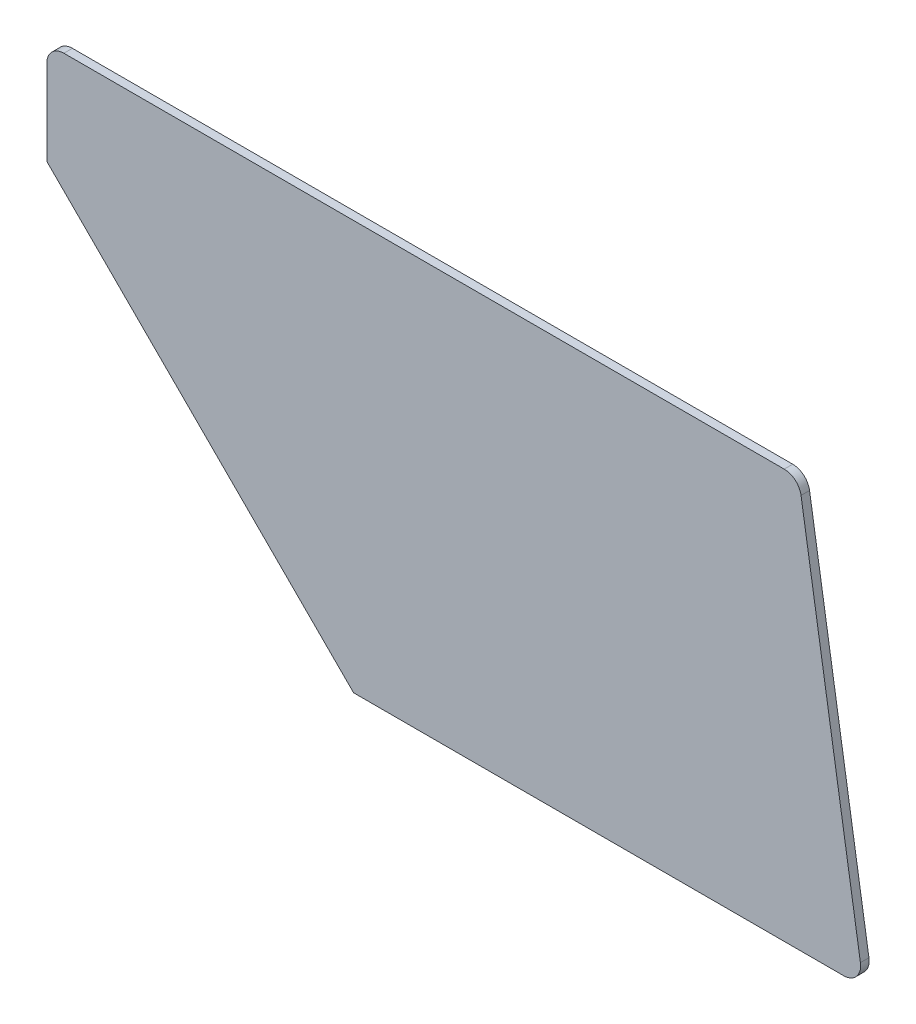
ISO-10303-21;
HEADER;
FILE_DESCRIPTION(('STEP AP214'),'2;1');
FILE_NAME('part.step','',(''),(''),'','','');
FILE_SCHEMA(('AUTOMOTIVE_DESIGN { 1 0 10303 214 1 1 1 1 }'));
ENDSEC;
DATA;
#1=APPLICATION_CONTEXT('core data for automotive mechanical design processes');
#2=APPLICATION_PROTOCOL_DEFINITION('international standard','automotive_design',2000,#1);
#3=PRODUCT_CONTEXT('',#1,'mechanical');
#4=PRODUCT('Part','Part','',(#3));
#5=PRODUCT_RELATED_PRODUCT_CATEGORY('part','',(#4));
#6=PRODUCT_DEFINITION_FORMATION('','',#4);
#7=PRODUCT_DEFINITION_CONTEXT('part definition',#1,'design');
#8=PRODUCT_DEFINITION('design','',#6,#7);
#9=PRODUCT_DEFINITION_SHAPE('','',#8);
#10=(LENGTH_UNIT() NAMED_UNIT(*) SI_UNIT(.MILLI.,.METRE.));
#11=(NAMED_UNIT(*) PLANE_ANGLE_UNIT() SI_UNIT($,.RADIAN.));
#12=(NAMED_UNIT(*) SI_UNIT($,.STERADIAN.) SOLID_ANGLE_UNIT());
#13=UNCERTAINTY_MEASURE_WITH_UNIT(LENGTH_MEASURE(1.E-05),#10,'distance_accuracy_value','');
#14=(GEOMETRIC_REPRESENTATION_CONTEXT(3) GLOBAL_UNCERTAINTY_ASSIGNED_CONTEXT((#13)) GLOBAL_UNIT_ASSIGNED_CONTEXT((#10,
#11,#12)) REPRESENTATION_CONTEXT('',''));
#15=CARTESIAN_POINT('',(0.,0.,0.));
#16=DIRECTION('',(0.,0.,1.));
#17=DIRECTION('',(1.,0.,0.));
#18=AXIS2_PLACEMENT_3D('',#15,#16,#17);
#19=CARTESIAN_POINT('',(0.,-38.1,3.175));
#20=DIRECTION('',(0.707106781186549,0.707106781186546,0.));
#21=DIRECTION('',(-0.707106781186546,0.707106781186549,0.));
#22=AXIS2_PLACEMENT_3D('',#19,#20,#21);
#23=PLANE('',#22);
#24=DIRECTION('',(0.707106781186546,-0.707106781186549,0.));
#25=VECTOR('',#24,1.);
#26=CARTESIAN_POINT('',(0.,-38.1,0.));
#27=LINE('',#26,#25);
#28=CARTESIAN_POINT('',(0.,-38.1,0.));
#29=VERTEX_POINT('',#28);
#30=CARTESIAN_POINT('',(114.3,-152.4,0.));
#31=VERTEX_POINT('',#30);
#32=EDGE_CURVE('E128',#29,#31,#27,.T.);
#33=ORIENTED_EDGE('',*,*,#32,.T.);
#34=DIRECTION('',(0.,0.,-1.));
#35=VECTOR('',#34,1.);
#36=CARTESIAN_POINT('',(114.3,-152.4,3.175));
#37=LINE('',#36,#35);
#38=CARTESIAN_POINT('',(114.3,-152.4,3.175));
#39=VERTEX_POINT('',#38);
#40=EDGE_CURVE('E11',#39,#31,#37,.T.);
#41=ORIENTED_EDGE('',*,*,#40,.F.);
#42=DIRECTION('',(0.707106781186546,-0.707106781186549,0.));
#43=VECTOR('',#42,1.);
#44=CARTESIAN_POINT('',(0.,-38.1,3.175));
#45=LINE('',#44,#43);
#46=CARTESIAN_POINT('',(0.,-38.1,3.175));
#47=VERTEX_POINT('',#46);
#48=EDGE_CURVE('E142',#47,#39,#45,.T.);
#49=ORIENTED_EDGE('',*,*,#48,.F.);
#50=DIRECTION('',(0.,0.,-1.));
#51=VECTOR('',#50,1.);
#52=CARTESIAN_POINT('',(0.,-38.1,3.175));
#53=LINE('',#52,#51);
#54=EDGE_CURVE('E124',#47,#29,#53,.T.);
#55=ORIENTED_EDGE('',*,*,#54,.T.);
#56=EDGE_LOOP('',(#33,#41,#49,#55));
#57=FACE_BOUND('',#56,.T.);
#58=ADVANCED_FACE('F32',(#57),#23,.F.);
#59=CARTESIAN_POINT('',(114.3,-152.4,3.175));
#60=DIRECTION('',(0.,1.,0.));
#61=DIRECTION('',(-1.,0.,0.));
#62=AXIS2_PLACEMENT_3D('',#59,#60,#61);
#63=PLANE('',#62);
#64=DIRECTION('',(1.,0.,0.));
#65=VECTOR('',#64,1.);
#66=CARTESIAN_POINT('',(114.3,-152.4,0.));
#67=LINE('',#66,#65);
#68=CARTESIAN_POINT('',(296.8625,-152.4,0.));
#69=VERTEX_POINT('',#68);
#70=EDGE_CURVE('E131',#31,#69,#67,.T.);
#71=ORIENTED_EDGE('',*,*,#70,.T.);
#72=DIRECTION('',(0.,0.,-1.));
#73=VECTOR('',#72,1.);
#74=CARTESIAN_POINT('',(296.8625,-152.4,3.175));
#75=LINE('',#74,#73);
#76=CARTESIAN_POINT('',(296.8625,-152.4,3.175));
#77=VERTEX_POINT('',#76);
#78=EDGE_CURVE('E40',#77,#69,#75,.T.);
#79=ORIENTED_EDGE('',*,*,#78,.F.);
#80=DIRECTION('',(1.,0.,0.));
#81=VECTOR('',#80,1.);
#82=CARTESIAN_POINT('',(114.3,-152.4,3.175));
#83=LINE('',#82,#81);
#84=EDGE_CURVE('E91',#39,#77,#83,.T.);
#85=ORIENTED_EDGE('',*,*,#84,.F.);
#86=ORIENTED_EDGE('',*,*,#40,.T.);
#87=EDGE_LOOP('',(#71,#79,#85,#86));
#88=FACE_BOUND('',#87,.T.);
#89=ADVANCED_FACE('F177',(#88),#63,.F.);
#90=CARTESIAN_POINT('',(296.8625,-146.05,3.175));
#91=DIRECTION('',(0.,0.,-1.));
#92=DIRECTION('',(-1.,0.,0.));
#93=AXIS2_PLACEMENT_3D('',#90,#91,#92);
#94=CYLINDRICAL_SURFACE('',#93,6.34999999999993);
#95=CARTESIAN_POINT('',(296.8625,-146.05,0.));
#96=DIRECTION('',(0.,0.,1.));
#97=DIRECTION('',(1.,0.,0.));
#98=AXIS2_PLACEMENT_3D('',#95,#96,#97);
#99=CIRCLE('',#98,6.34999999999993);
#100=CARTESIAN_POINT('',(303.134320962779,-145.056641146995,0.));
#101=VERTEX_POINT('',#100);
#102=EDGE_CURVE('E133',#69,#101,#99,.T.);
#103=ORIENTED_EDGE('',*,*,#102,.T.);
#104=DIRECTION('',(0.,0.,-1.));
#105=VECTOR('',#104,1.);
#106=CARTESIAN_POINT('',(303.134320962779,-145.056641146995,3.175));
#107=LINE('',#106,#105);
#108=CARTESIAN_POINT('',(303.134320962779,-145.056641146995,3.175));
#109=VERTEX_POINT('',#108);
#110=EDGE_CURVE('E149',#109,#101,#107,.T.);
#111=ORIENTED_EDGE('',*,*,#110,.F.);
#112=CARTESIAN_POINT('',(296.8625,-146.05,3.175));
#113=DIRECTION('',(0.,0.,1.));
#114=DIRECTION('',(1.,0.,0.));
#115=AXIS2_PLACEMENT_3D('',#112,#113,#114);
#116=CIRCLE('',#115,6.34999999999993);
#117=EDGE_CURVE('E157',#77,#109,#116,.T.);
#118=ORIENTED_EDGE('',*,*,#117,.F.);
#119=ORIENTED_EDGE('',*,*,#78,.T.);
#120=EDGE_LOOP('',(#103,#111,#118,#119));
#121=FACE_BOUND('',#120,.T.);
#122=ADVANCED_FACE('F155',(#121),#94,.T.);
#123=CARTESIAN_POINT('',(303.134320962779,-145.056641146995,3.175));
#124=DIRECTION('',(-0.987688340595137,-0.156434465040235,0.));
#125=DIRECTION('',(0.156434465040235,-0.987688340595137,0.));
#126=AXIS2_PLACEMENT_3D('',#123,#124,#125);
#127=PLANE('',#126);
#128=DIRECTION('',(-0.156434465040235,0.987688340595137,0.));
#129=VECTOR('',#128,1.);
#130=CARTESIAN_POINT('',(303.134320962779,-145.056641146995,0.));
#131=LINE('',#130,#129);
#132=CARTESIAN_POINT('',(281.008014649441,-5.35664114699449,0.));
#133=VERTEX_POINT('',#132);
#134=EDGE_CURVE('E135',#101,#133,#131,.T.);
#135=ORIENTED_EDGE('',*,*,#134,.T.);
#136=DIRECTION('',(0.,0.,-1.));
#137=VECTOR('',#136,1.);
#138=CARTESIAN_POINT('',(281.008014649441,-5.35664114699449,3.175));
#139=LINE('',#138,#137);
#140=CARTESIAN_POINT('',(281.008014649441,-5.35664114699449,3.175));
#141=VERTEX_POINT('',#140);
#142=EDGE_CURVE('E146',#141,#133,#139,.T.);
#143=ORIENTED_EDGE('',*,*,#142,.F.);
#144=DIRECTION('',(-0.156434465040235,0.987688340595137,0.));
#145=VECTOR('',#144,1.);
#146=CARTESIAN_POINT('',(303.134320962779,-145.056641146995,3.175));
#147=LINE('',#146,#145);
#148=EDGE_CURVE('E169',#109,#141,#147,.T.);
#149=ORIENTED_EDGE('',*,*,#148,.F.);
#150=ORIENTED_EDGE('',*,*,#110,.T.);
#151=EDGE_LOOP('',(#135,#143,#149,#150));
#152=FACE_BOUND('',#151,.T.);
#153=ADVANCED_FACE('F165',(#152),#127,.F.);
#154=CARTESIAN_POINT('',(274.736193686662,-6.34999999999997,3.175));
#155=DIRECTION('',(0.,0.,-1.));
#156=DIRECTION('',(-1.,0.,0.));
#157=AXIS2_PLACEMENT_3D('',#154,#155,#156);
#158=CYLINDRICAL_SURFACE('',#157,6.34999999999993);
#159=CARTESIAN_POINT('',(274.736193686662,-6.34999999999997,0.));
#160=DIRECTION('',(0.,0.,1.));
#161=DIRECTION('',(-1.,0.,0.));
#162=AXIS2_PLACEMENT_3D('',#159,#160,#161);
#163=CIRCLE('',#162,6.34999999999993);
#164=CARTESIAN_POINT('',(274.736193686662,0.,0.));
#165=VERTEX_POINT('',#164);
#166=EDGE_CURVE('E137',#133,#165,#163,.T.);
#167=ORIENTED_EDGE('',*,*,#166,.T.);
#168=DIRECTION('',(0.,0.,-1.));
#169=VECTOR('',#168,1.);
#170=CARTESIAN_POINT('',(274.736193686662,0.,3.175));
#171=LINE('',#170,#169);
#172=CARTESIAN_POINT('',(274.736193686662,0.,3.175));
#173=VERTEX_POINT('',#172);
#174=EDGE_CURVE('E119',#173,#165,#171,.T.);
#175=ORIENTED_EDGE('',*,*,#174,.F.);
#176=CARTESIAN_POINT('',(274.736193686662,-6.34999999999997,3.175));
#177=DIRECTION('',(0.,0.,1.));
#178=DIRECTION('',(-1.,0.,0.));
#179=AXIS2_PLACEMENT_3D('',#176,#177,#178);
#180=CIRCLE('',#179,6.34999999999993);
#181=EDGE_CURVE('E110',#141,#173,#180,.T.);
#182=ORIENTED_EDGE('',*,*,#181,.F.);
#183=ORIENTED_EDGE('',*,*,#142,.T.);
#184=EDGE_LOOP('',(#167,#175,#182,#183));
#185=FACE_BOUND('',#184,.T.);
#186=ADVANCED_FACE('F168',(#185),#158,.T.);
#187=CARTESIAN_POINT('',(274.736193686662,0.,3.175));
#188=DIRECTION('',(0.,-1.,0.));
#189=DIRECTION('',(1.,0.,0.));
#190=AXIS2_PLACEMENT_3D('',#187,#188,#189);
#191=PLANE('',#190);
#192=DIRECTION('',(-1.,0.,0.));
#193=VECTOR('',#192,1.);
#194=CARTESIAN_POINT('',(274.736193686662,0.,0.));
#195=LINE('',#194,#193);
#196=CARTESIAN_POINT('',(6.35000000000004,0.,0.));
#197=VERTEX_POINT('',#196);
#198=EDGE_CURVE('E118',#165,#197,#195,.T.);
#199=ORIENTED_EDGE('',*,*,#198,.T.);
#200=DIRECTION('',(0.,0.,-1.));
#201=VECTOR('',#200,1.);
#202=CARTESIAN_POINT('',(6.35000000000004,0.,3.175));
#203=LINE('',#202,#201);
#204=CARTESIAN_POINT('',(6.35000000000004,0.,3.175));
#205=VERTEX_POINT('',#204);
#206=EDGE_CURVE('E115',#205,#197,#203,.T.);
#207=ORIENTED_EDGE('',*,*,#206,.F.);
#208=DIRECTION('',(-1.,0.,0.));
#209=VECTOR('',#208,1.);
#210=CARTESIAN_POINT('',(274.736193686662,0.,3.175));
#211=LINE('',#210,#209);
#212=EDGE_CURVE('E104',#173,#205,#211,.T.);
#213=ORIENTED_EDGE('',*,*,#212,.F.);
#214=ORIENTED_EDGE('',*,*,#174,.T.);
#215=EDGE_LOOP('',(#199,#207,#213,#214));
#216=FACE_BOUND('',#215,.T.);
#217=ADVANCED_FACE('F116',(#216),#191,.F.);
#218=CARTESIAN_POINT('',(6.35,-6.35,3.175));
#219=DIRECTION('',(0.,0.,-1.));
#220=DIRECTION('',(-1.,0.,0.));
#221=AXIS2_PLACEMENT_3D('',#218,#219,#220);
#222=CYLINDRICAL_SURFACE('',#221,6.35);
#223=CARTESIAN_POINT('',(6.35,-6.35,0.));
#224=DIRECTION('',(0.,0.,1.));
#225=DIRECTION('',(1.,0.,0.));
#226=AXIS2_PLACEMENT_3D('',#223,#224,#225);
#227=CIRCLE('',#226,6.35);
#228=CARTESIAN_POINT('',(0.,-6.35000000000004,0.));
#229=VERTEX_POINT('',#228);
#230=EDGE_CURVE('E77',#197,#229,#227,.T.);
#231=ORIENTED_EDGE('',*,*,#230,.T.);
#232=DIRECTION('',(0.,0.,-1.));
#233=VECTOR('',#232,1.);
#234=CARTESIAN_POINT('',(0.,-6.35000000000004,3.175));
#235=LINE('',#234,#233);
#236=CARTESIAN_POINT('',(0.,-6.35000000000004,3.175));
#237=VERTEX_POINT('',#236);
#238=EDGE_CURVE('E120',#237,#229,#235,.T.);
#239=ORIENTED_EDGE('',*,*,#238,.F.);
#240=CARTESIAN_POINT('',(6.35,-6.35,3.175));
#241=DIRECTION('',(0.,0.,1.));
#242=DIRECTION('',(1.,0.,0.));
#243=AXIS2_PLACEMENT_3D('',#240,#241,#242);
#244=CIRCLE('',#243,6.35);
#245=EDGE_CURVE('E108',#205,#237,#244,.T.);
#246=ORIENTED_EDGE('',*,*,#245,.F.);
#247=ORIENTED_EDGE('',*,*,#206,.T.);
#248=EDGE_LOOP('',(#231,#239,#246,#247));
#249=FACE_BOUND('',#248,.T.);
#250=ADVANCED_FACE('F122',(#249),#222,.T.);
#251=CARTESIAN_POINT('',(0.,-6.35000000000004,3.175));
#252=DIRECTION('',(1.,0.,0.));
#253=DIRECTION('',(0.,0.,-1.));
#254=AXIS2_PLACEMENT_3D('',#251,#252,#253);
#255=PLANE('',#254);
#256=DIRECTION('',(0.,-1.,0.));
#257=VECTOR('',#256,1.);
#258=CARTESIAN_POINT('',(0.,-6.35000000000004,0.));
#259=LINE('',#258,#257);
#260=EDGE_CURVE('E83',#229,#29,#259,.T.);
#261=ORIENTED_EDGE('',*,*,#260,.T.);
#262=ORIENTED_EDGE('',*,*,#54,.F.);
#263=DIRECTION('',(0.,-1.,0.));
#264=VECTOR('',#263,1.);
#265=CARTESIAN_POINT('',(0.,-6.35000000000004,3.175));
#266=LINE('',#265,#264);
#267=EDGE_CURVE('E48',#237,#47,#266,.T.);
#268=ORIENTED_EDGE('',*,*,#267,.F.);
#269=ORIENTED_EDGE('',*,*,#238,.T.);
#270=EDGE_LOOP('',(#261,#262,#268,#269));
#271=FACE_BOUND('',#270,.T.);
#272=ADVANCED_FACE('F193',(#271),#255,.F.);
#273=CARTESIAN_POINT('',(296.8625,-146.05,3.175));
#274=DIRECTION('',(0.,0.,1.));
#275=DIRECTION('',(1.,0.,0.));
#276=AXIS2_PLACEMENT_3D('',#273,#274,#275);
#277=PLANE('',#276);
#278=ORIENTED_EDGE('',*,*,#48,.T.);
#279=ORIENTED_EDGE('',*,*,#84,.T.);
#280=ORIENTED_EDGE('',*,*,#117,.T.);
#281=ORIENTED_EDGE('',*,*,#148,.T.);
#282=ORIENTED_EDGE('',*,*,#181,.T.);
#283=ORIENTED_EDGE('',*,*,#212,.T.);
#284=ORIENTED_EDGE('',*,*,#245,.T.);
#285=ORIENTED_EDGE('',*,*,#267,.T.);
#286=EDGE_LOOP('',(#278,#279,#280,#281,#282,#283,#284,#285));
#287=FACE_BOUND('',#286,.T.);
#288=ADVANCED_FACE('F106',(#287),#277,.T.);
#289=CARTESIAN_POINT('',(296.8625,-146.05,0.));
#290=DIRECTION('',(0.,0.,1.));
#291=DIRECTION('',(1.,0.,0.));
#292=AXIS2_PLACEMENT_3D('',#289,#290,#291);
#293=PLANE('',#292);
#294=ORIENTED_EDGE('',*,*,#32,.F.);
#295=ORIENTED_EDGE('',*,*,#260,.F.);
#296=ORIENTED_EDGE('',*,*,#230,.F.);
#297=ORIENTED_EDGE('',*,*,#198,.F.);
#298=ORIENTED_EDGE('',*,*,#166,.F.);
#299=ORIENTED_EDGE('',*,*,#134,.F.);
#300=ORIENTED_EDGE('',*,*,#102,.F.);
#301=ORIENTED_EDGE('',*,*,#70,.F.);
#302=EDGE_LOOP('',(#294,#295,#296,#297,#298,#299,#300,#301));
#303=FACE_BOUND('',#302,.T.);
#304=ADVANCED_FACE('F161',(#303),#293,.F.);
#305=CLOSED_SHELL('',(#58,#89,#122,#153,#186,#217,#250,#272,#288,#304));
#306=MANIFOLD_SOLID_BREP('B2',#305);
#307=ADVANCED_BREP_SHAPE_REPRESENTATION('',(#18,#306),#14);
#308=SHAPE_DEFINITION_REPRESENTATION(#9,#307);
ENDSEC;
END-ISO-10303-21;
